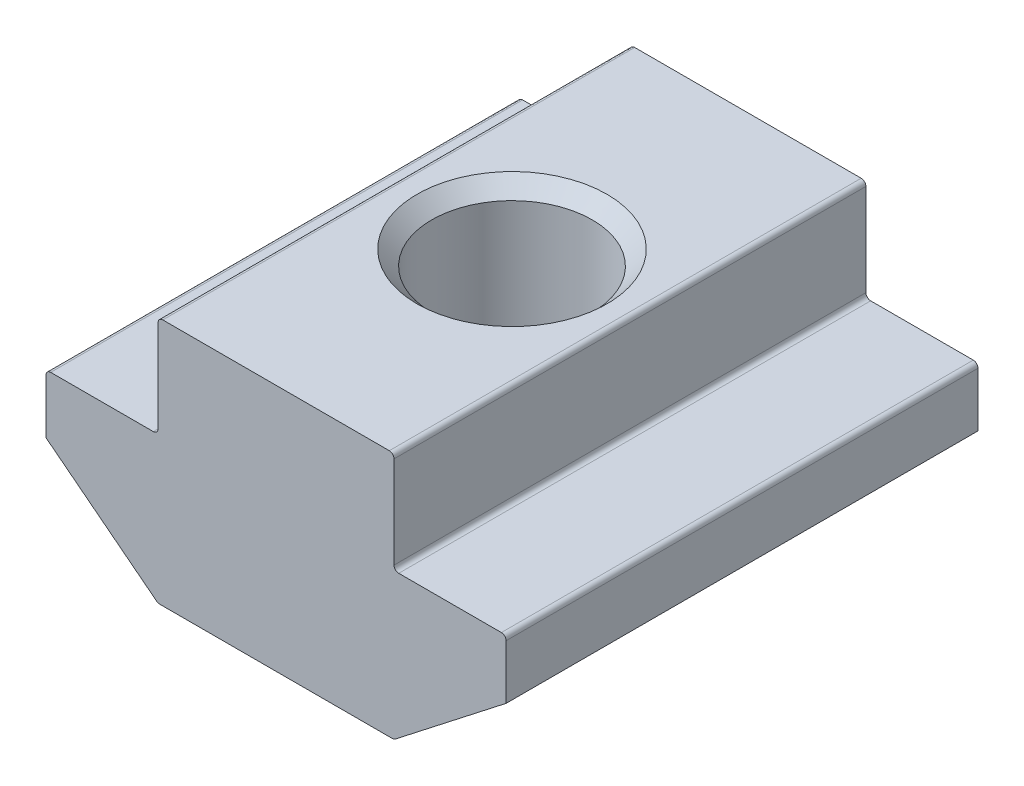
ISO-10303-21;
HEADER;
FILE_DESCRIPTION(('STEP AP214'),'2;1');
FILE_NAME('part.step','',(''),(''),'','','');
FILE_SCHEMA(('AUTOMOTIVE_DESIGN { 1 0 10303 214 1 1 1 1 }'));
ENDSEC;
DATA;
#1=APPLICATION_CONTEXT('core data for automotive mechanical design processes');
#2=APPLICATION_PROTOCOL_DEFINITION('international standard','automotive_design',2000,#1);
#3=PRODUCT_CONTEXT('',#1,'mechanical');
#4=PRODUCT('Part','Part','',(#3));
#5=PRODUCT_RELATED_PRODUCT_CATEGORY('part','',(#4));
#6=PRODUCT_DEFINITION_FORMATION('','',#4);
#7=PRODUCT_DEFINITION_CONTEXT('part definition',#1,'design');
#8=PRODUCT_DEFINITION('design','',#6,#7);
#9=PRODUCT_DEFINITION_SHAPE('','',#8);
#10=(LENGTH_UNIT() NAMED_UNIT(*) SI_UNIT(.MILLI.,.METRE.));
#11=(NAMED_UNIT(*) PLANE_ANGLE_UNIT() SI_UNIT($,.RADIAN.));
#12=(NAMED_UNIT(*) SI_UNIT($,.STERADIAN.) SOLID_ANGLE_UNIT());
#13=UNCERTAINTY_MEASURE_WITH_UNIT(LENGTH_MEASURE(1.E-05),#10,'distance_accuracy_value','');
#14=(GEOMETRIC_REPRESENTATION_CONTEXT(3) GLOBAL_UNCERTAINTY_ASSIGNED_CONTEXT((#13)) GLOBAL_UNIT_ASSIGNED_CONTEXT((#10,
#11,#12)) REPRESENTATION_CONTEXT('',''));
#15=CARTESIAN_POINT('',(0.,0.,0.));
#16=DIRECTION('',(0.,0.,1.));
#17=DIRECTION('',(1.,0.,0.));
#18=AXIS2_PLACEMENT_3D('',#15,#16,#17);
#19=CARTESIAN_POINT('',(-5.,0.,10.));
#20=DIRECTION('',(1.,0.,0.));
#21=DIRECTION('',(0.,1.,0.));
#22=AXIS2_PLACEMENT_3D('',#19,#20,#21);
#23=PLANE('',#22);
#24=DIRECTION('',(0.,-1.,0.));
#25=VECTOR('',#24,1.);
#26=CARTESIAN_POINT('',(-5.,0.,10.));
#27=LINE('',#26,#25);
#28=CARTESIAN_POINT('',(-5.,-0.200000000000003,10.));
#29=VERTEX_POINT('',#28);
#30=CARTESIAN_POINT('',(-5.,-4.1,10.));
#31=VERTEX_POINT('',#30);
#32=EDGE_CURVE('E233',#29,#31,#27,.T.);
#33=ORIENTED_EDGE('',*,*,#32,.F.);
#34=DIRECTION('',(0.,0.,-1.));
#35=VECTOR('',#34,1.);
#36=CARTESIAN_POINT('',(-5.,-0.200000000000003,10.));
#37=LINE('',#36,#35);
#38=CARTESIAN_POINT('',(-5.,-0.200000000000003,-10.));
#39=VERTEX_POINT('',#38);
#40=EDGE_CURVE('E284',#29,#39,#37,.T.);
#41=ORIENTED_EDGE('',*,*,#40,.T.);
#42=DIRECTION('',(0.,-1.,0.));
#43=VECTOR('',#42,1.);
#44=CARTESIAN_POINT('',(-5.,0.,-10.));
#45=LINE('',#44,#43);
#46=CARTESIAN_POINT('',(-5.,-4.1,-10.));
#47=VERTEX_POINT('',#46);
#48=EDGE_CURVE('E207',#39,#47,#45,.T.);
#49=ORIENTED_EDGE('',*,*,#48,.T.);
#50=DIRECTION('',(0.,0.,-1.));
#51=VECTOR('',#50,1.);
#52=CARTESIAN_POINT('',(-5.,-4.1,10.));
#53=LINE('',#52,#51);
#54=EDGE_CURVE('E282',#47,#31,#53,.F.);
#55=ORIENTED_EDGE('',*,*,#54,.T.);
#56=EDGE_LOOP('',(#33,#41,#49,#55));
#57=FACE_BOUND('',#56,.T.);
#58=ADVANCED_FACE('F36',(#57),#23,.F.);
#59=CARTESIAN_POINT('',(-5.,-4.3,10.));
#60=DIRECTION('',(0.,-1.,0.));
#61=DIRECTION('',(1.,0.,0.));
#62=AXIS2_PLACEMENT_3D('',#59,#60,#61);
#63=PLANE('',#62);
#64=DIRECTION('',(-1.,0.,0.));
#65=VECTOR('',#64,1.);
#66=CARTESIAN_POINT('',(-5.,-4.3,-10.));
#67=LINE('',#66,#65);
#68=CARTESIAN_POINT('',(-5.2,-4.3,-10.));
#69=VERTEX_POINT('',#68);
#70=CARTESIAN_POINT('',(-9.55,-4.3,-10.));
#71=VERTEX_POINT('',#70);
#72=EDGE_CURVE('E210',#69,#71,#67,.T.);
#73=ORIENTED_EDGE('',*,*,#72,.T.);
#74=DIRECTION('',(0.,0.,-1.));
#75=VECTOR('',#74,1.);
#76=CARTESIAN_POINT('',(-9.55,-4.3,10.));
#77=LINE('',#76,#75);
#78=CARTESIAN_POINT('',(-9.55,-4.3,10.));
#79=VERTEX_POINT('',#78);
#80=EDGE_CURVE('E292',#71,#79,#77,.F.);
#81=ORIENTED_EDGE('',*,*,#80,.T.);
#82=DIRECTION('',(-1.,0.,0.));
#83=VECTOR('',#82,1.);
#84=CARTESIAN_POINT('',(-5.,-4.3,10.));
#85=LINE('',#84,#83);
#86=CARTESIAN_POINT('',(-5.2,-4.3,10.));
#87=VERTEX_POINT('',#86);
#88=EDGE_CURVE('E174',#87,#79,#85,.T.);
#89=ORIENTED_EDGE('',*,*,#88,.F.);
#90=DIRECTION('',(0.,0.,-1.));
#91=VECTOR('',#90,1.);
#92=CARTESIAN_POINT('',(-5.2,-4.3,-10.));
#93=LINE('',#92,#91);
#94=EDGE_CURVE('E289',#87,#69,#93,.T.);
#95=ORIENTED_EDGE('',*,*,#94,.T.);
#96=EDGE_LOOP('',(#73,#81,#89,#95));
#97=FACE_BOUND('',#96,.T.);
#98=ADVANCED_FACE('F312',(#97),#63,.F.);
#99=CARTESIAN_POINT('',(-9.75,-4.3,10.));
#100=DIRECTION('',(1.,0.,0.));
#101=DIRECTION('',(0.,0.,-1.));
#102=AXIS2_PLACEMENT_3D('',#99,#100,#101);
#103=PLANE('',#102);
#104=DIRECTION('',(0.,-1.,0.));
#105=VECTOR('',#104,1.);
#106=CARTESIAN_POINT('',(-9.75,-4.3,10.));
#107=LINE('',#106,#105);
#108=CARTESIAN_POINT('',(-9.75,-4.5,10.));
#109=VERTEX_POINT('',#108);
#110=CARTESIAN_POINT('',(-9.75,-6.8,10.));
#111=VERTEX_POINT('',#110);
#112=EDGE_CURVE('E161',#109,#111,#107,.T.);
#113=ORIENTED_EDGE('',*,*,#112,.F.);
#114=DIRECTION('',(0.,0.,-1.));
#115=VECTOR('',#114,1.);
#116=CARTESIAN_POINT('',(-9.75,-4.5,10.));
#117=LINE('',#116,#115);
#118=CARTESIAN_POINT('',(-9.75,-4.5,-10.));
#119=VERTEX_POINT('',#118);
#120=EDGE_CURVE('E287',#109,#119,#117,.T.);
#121=ORIENTED_EDGE('',*,*,#120,.T.);
#122=DIRECTION('',(0.,-1.,0.));
#123=VECTOR('',#122,1.);
#124=CARTESIAN_POINT('',(-9.75,-4.3,-10.));
#125=LINE('',#124,#123);
#126=CARTESIAN_POINT('',(-9.75,-6.8,-10.));
#127=VERTEX_POINT('',#126);
#128=EDGE_CURVE('E180',#119,#127,#125,.T.);
#129=ORIENTED_EDGE('',*,*,#128,.T.);
#130=DIRECTION('',(0.,0.,-1.));
#131=VECTOR('',#130,1.);
#132=CARTESIAN_POINT('',(-9.75,-6.8,10.));
#133=LINE('',#132,#131);
#134=EDGE_CURVE('E177',#111,#127,#133,.T.);
#135=ORIENTED_EDGE('',*,*,#134,.F.);
#136=EDGE_LOOP('',(#113,#121,#129,#135));
#137=FACE_BOUND('',#136,.T.);
#138=ADVANCED_FACE('F178',(#137),#103,.F.);
#139=CARTESIAN_POINT('',(-9.75,-6.8,10.));
#140=DIRECTION('',(0.614515361098146,0.788904855463836,0.));
#141=DIRECTION('',(-0.788904855463836,0.614515361098146,0.));
#142=AXIS2_PLACEMENT_3D('',#139,#140,#141);
#143=PLANE('',#142);
#144=DIRECTION('',(0.788904855463836,-0.614515361098146,0.));
#145=VECTOR('',#144,1.);
#146=CARTESIAN_POINT('',(-9.75,-6.8,-10.));
#147=LINE('',#146,#145);
#148=CARTESIAN_POINT('',(-5.05420010467821,-10.4577809710928,-10.));
#149=VERTEX_POINT('',#148);
#150=EDGE_CURVE('E215',#127,#149,#147,.T.);
#151=ORIENTED_EDGE('',*,*,#150,.T.);
#152=DIRECTION('',(0.,0.,-1.));
#153=VECTOR('',#152,1.);
#154=CARTESIAN_POINT('',(-5.05420010467821,-10.4577809710928,10.));
#155=LINE('',#154,#153);
#156=CARTESIAN_POINT('',(-5.05420010467821,-10.4577809710928,10.));
#157=VERTEX_POINT('',#156);
#158=EDGE_CURVE('E189',#149,#157,#155,.F.);
#159=ORIENTED_EDGE('',*,*,#158,.T.);
#160=DIRECTION('',(0.788904855463836,-0.614515361098146,0.));
#161=VECTOR('',#160,1.);
#162=CARTESIAN_POINT('',(-9.75,-6.8,10.));
#163=LINE('',#162,#161);
#164=EDGE_CURVE('E166',#111,#157,#163,.T.);
#165=ORIENTED_EDGE('',*,*,#164,.F.);
#166=ORIENTED_EDGE('',*,*,#134,.T.);
#167=EDGE_LOOP('',(#151,#159,#165,#166));
#168=FACE_BOUND('',#167,.T.);
#169=ADVANCED_FACE('F187',(#168),#143,.F.);
#170=CARTESIAN_POINT('',(-5.,-10.5,10.));
#171=DIRECTION('',(0.,1.,0.));
#172=DIRECTION('',(0.,0.,1.));
#173=AXIS2_PLACEMENT_3D('',#170,#171,#172);
#174=PLANE('',#173);
#175=CARTESIAN_POINT('',(0.,-10.5,0.));
#176=DIRECTION('',(0.,1.,0.));
#177=DIRECTION('',(0.,0.,1.));
#178=AXIS2_PLACEMENT_3D('',#175,#176,#177);
#179=CIRCLE('',#178,4.025);
#180=CARTESIAN_POINT('',(0.,-10.5,4.025));
#181=VERTEX_POINT('',#180);
#182=EDGE_CURVE('E324',#181,#181,#179,.T.);
#183=ORIENTED_EDGE('',*,*,#182,.T.);
#184=EDGE_LOOP('',(#183));
#185=FACE_BOUND('',#184,.T.);
#186=DIRECTION('',(1.,0.,0.));
#187=VECTOR('',#186,1.);
#188=CARTESIAN_POINT('',(-5.,-10.5,-10.));
#189=LINE('',#188,#187);
#190=CARTESIAN_POINT('',(-4.93129703245858,-10.5,-10.));
#191=VERTEX_POINT('',#190);
#192=CARTESIAN_POINT('',(4.93129703245858,-10.5,-10.));
#193=VERTEX_POINT('',#192);
#194=EDGE_CURVE('E217',#191,#193,#189,.T.);
#195=ORIENTED_EDGE('',*,*,#194,.T.);
#196=DIRECTION('',(0.,0.,-1.));
#197=VECTOR('',#196,1.);
#198=CARTESIAN_POINT('',(4.93129703245858,-10.5,10.));
#199=LINE('',#198,#197);
#200=CARTESIAN_POINT('',(4.93129703245858,-10.5,10.));
#201=VERTEX_POINT('',#200);
#202=EDGE_CURVE('E253',#193,#201,#199,.F.);
#203=ORIENTED_EDGE('',*,*,#202,.T.);
#204=DIRECTION('',(1.,0.,0.));
#205=VECTOR('',#204,1.);
#206=CARTESIAN_POINT('',(-5.,-10.5,10.));
#207=LINE('',#206,#205);
#208=CARTESIAN_POINT('',(-4.93129703245858,-10.5,10.));
#209=VERTEX_POINT('',#208);
#210=EDGE_CURVE('E190',#209,#201,#207,.T.);
#211=ORIENTED_EDGE('',*,*,#210,.F.);
#212=DIRECTION('',(0.,0.,-1.));
#213=VECTOR('',#212,1.);
#214=CARTESIAN_POINT('',(-4.93129703245858,-10.5,10.));
#215=LINE('',#214,#213);
#216=EDGE_CURVE('E250',#209,#191,#215,.T.);
#217=ORIENTED_EDGE('',*,*,#216,.T.);
#218=EDGE_LOOP('',(#195,#203,#211,#217));
#219=FACE_BOUND('',#218,.T.);
#220=ADVANCED_FACE('F328',(#185,#219),#174,.F.);
#221=CARTESIAN_POINT('',(9.75,-6.8,10.));
#222=DIRECTION('',(-0.614515361098146,0.788904855463836,0.));
#223=DIRECTION('',(-0.788904855463836,-0.614515361098146,0.));
#224=AXIS2_PLACEMENT_3D('',#221,#222,#223);
#225=PLANE('',#224);
#226=DIRECTION('',(0.788904855463836,0.614515361098146,0.));
#227=VECTOR('',#226,1.);
#228=CARTESIAN_POINT('',(9.75,-6.8,10.));
#229=LINE('',#228,#227);
#230=CARTESIAN_POINT('',(5.05420010467821,-10.4577809710928,10.));
#231=VERTEX_POINT('',#230);
#232=CARTESIAN_POINT('',(9.75,-6.8,10.));
#233=VERTEX_POINT('',#232);
#234=EDGE_CURVE('E192',#231,#233,#229,.T.);
#235=ORIENTED_EDGE('',*,*,#234,.F.);
#236=DIRECTION('',(0.,0.,-1.));
#237=VECTOR('',#236,1.);
#238=CARTESIAN_POINT('',(5.05420010467821,-10.4577809710928,10.));
#239=LINE('',#238,#237);
#240=CARTESIAN_POINT('',(5.05420010467821,-10.4577809710928,-10.));
#241=VERTEX_POINT('',#240);
#242=EDGE_CURVE('E184',#231,#241,#239,.T.);
#243=ORIENTED_EDGE('',*,*,#242,.T.);
#244=DIRECTION('',(0.788904855463836,0.614515361098146,0.));
#245=VECTOR('',#244,1.);
#246=CARTESIAN_POINT('',(9.75,-6.8,-10.));
#247=LINE('',#246,#245);
#248=CARTESIAN_POINT('',(9.75,-6.8,-10.));
#249=VERTEX_POINT('',#248);
#250=EDGE_CURVE('E220',#241,#249,#247,.T.);
#251=ORIENTED_EDGE('',*,*,#250,.T.);
#252=DIRECTION('',(0.,0.,-1.));
#253=VECTOR('',#252,1.);
#254=CARTESIAN_POINT('',(9.75,-6.8,10.));
#255=LINE('',#254,#253);
#256=EDGE_CURVE('E185',#233,#249,#255,.T.);
#257=ORIENTED_EDGE('',*,*,#256,.F.);
#258=EDGE_LOOP('',(#235,#243,#251,#257));
#259=FACE_BOUND('',#258,.T.);
#260=ADVANCED_FACE('F384',(#259),#225,.F.);
#261=CARTESIAN_POINT('',(9.75,-4.3,10.));
#262=DIRECTION('',(-1.,0.,0.));
#263=DIRECTION('',(0.,0.,1.));
#264=AXIS2_PLACEMENT_3D('',#261,#262,#263);
#265=PLANE('',#264);
#266=DIRECTION('',(0.,1.,0.));
#267=VECTOR('',#266,1.);
#268=CARTESIAN_POINT('',(9.75,-4.3,-10.));
#269=LINE('',#268,#267);
#270=CARTESIAN_POINT('',(9.75,-4.5,-10.));
#271=VERTEX_POINT('',#270);
#272=EDGE_CURVE('E222',#249,#271,#269,.T.);
#273=ORIENTED_EDGE('',*,*,#272,.T.);
#274=DIRECTION('',(0.,0.,-1.));
#275=VECTOR('',#274,1.);
#276=CARTESIAN_POINT('',(9.75,-4.5,10.));
#277=LINE('',#276,#275);
#278=CARTESIAN_POINT('',(9.75,-4.5,10.));
#279=VERTEX_POINT('',#278);
#280=EDGE_CURVE('E271',#271,#279,#277,.F.);
#281=ORIENTED_EDGE('',*,*,#280,.T.);
#282=DIRECTION('',(0.,1.,0.));
#283=VECTOR('',#282,1.);
#284=CARTESIAN_POINT('',(9.75,-4.3,10.));
#285=LINE('',#284,#283);
#286=EDGE_CURVE('E197',#233,#279,#285,.T.);
#287=ORIENTED_EDGE('',*,*,#286,.F.);
#288=ORIENTED_EDGE('',*,*,#256,.T.);
#289=EDGE_LOOP('',(#273,#281,#287,#288));
#290=FACE_BOUND('',#289,.T.);
#291=ADVANCED_FACE('F379',(#290),#265,.F.);
#292=CARTESIAN_POINT('',(5.,-4.3,10.));
#293=DIRECTION('',(0.,-1.,0.));
#294=DIRECTION('',(1.,0.,0.));
#295=AXIS2_PLACEMENT_3D('',#292,#293,#294);
#296=PLANE('',#295);
#297=DIRECTION('',(-1.,0.,0.));
#298=VECTOR('',#297,1.);
#299=CARTESIAN_POINT('',(5.,-4.3,10.));
#300=LINE('',#299,#298);
#301=CARTESIAN_POINT('',(9.55,-4.3,10.));
#302=VERTEX_POINT('',#301);
#303=CARTESIAN_POINT('',(5.2,-4.3,10.));
#304=VERTEX_POINT('',#303);
#305=EDGE_CURVE('E200',#302,#304,#300,.T.);
#306=ORIENTED_EDGE('',*,*,#305,.F.);
#307=DIRECTION('',(0.,0.,-1.));
#308=VECTOR('',#307,1.);
#309=CARTESIAN_POINT('',(9.55,-4.3,10.));
#310=LINE('',#309,#308);
#311=CARTESIAN_POINT('',(9.55,-4.3,-10.));
#312=VERTEX_POINT('',#311);
#313=EDGE_CURVE('E268',#302,#312,#310,.T.);
#314=ORIENTED_EDGE('',*,*,#313,.T.);
#315=DIRECTION('',(-1.,0.,0.));
#316=VECTOR('',#315,1.);
#317=CARTESIAN_POINT('',(5.,-4.3,-10.));
#318=LINE('',#317,#316);
#319=CARTESIAN_POINT('',(5.2,-4.3,-10.));
#320=VERTEX_POINT('',#319);
#321=EDGE_CURVE('E225',#312,#320,#318,.T.);
#322=ORIENTED_EDGE('',*,*,#321,.T.);
#323=DIRECTION('',(0.,0.,-1.));
#324=VECTOR('',#323,1.);
#325=CARTESIAN_POINT('',(5.2,-4.3,10.));
#326=LINE('',#325,#324);
#327=EDGE_CURVE('E266',#320,#304,#326,.F.);
#328=ORIENTED_EDGE('',*,*,#327,.T.);
#329=EDGE_LOOP('',(#306,#314,#322,#328));
#330=FACE_BOUND('',#329,.T.);
#331=ADVANCED_FACE('F371',(#330),#296,.F.);
#332=CARTESIAN_POINT('',(5.,0.,10.));
#333=DIRECTION('',(-1.,0.,0.));
#334=DIRECTION('',(0.,-1.,0.));
#335=AXIS2_PLACEMENT_3D('',#332,#333,#334);
#336=PLANE('',#335);
#337=DIRECTION('',(0.,1.,0.));
#338=VECTOR('',#337,1.);
#339=CARTESIAN_POINT('',(5.,0.,10.));
#340=LINE('',#339,#338);
#341=CARTESIAN_POINT('',(5.,-4.1,10.));
#342=VERTEX_POINT('',#341);
#343=CARTESIAN_POINT('',(5.,-0.199999999999997,10.));
#344=VERTEX_POINT('',#343);
#345=EDGE_CURVE('E203',#342,#344,#340,.T.);
#346=ORIENTED_EDGE('',*,*,#345,.F.);
#347=DIRECTION('',(0.,0.,-1.));
#348=VECTOR('',#347,1.);
#349=CARTESIAN_POINT('',(5.,-4.1,-10.));
#350=LINE('',#349,#348);
#351=CARTESIAN_POINT('',(5.,-4.1,-10.));
#352=VERTEX_POINT('',#351);
#353=EDGE_CURVE('E275',#342,#352,#350,.T.);
#354=ORIENTED_EDGE('',*,*,#353,.T.);
#355=DIRECTION('',(0.,1.,0.));
#356=VECTOR('',#355,1.);
#357=CARTESIAN_POINT('',(5.,0.,-10.));
#358=LINE('',#357,#356);
#359=CARTESIAN_POINT('',(5.,-0.199999999999997,-10.));
#360=VERTEX_POINT('',#359);
#361=EDGE_CURVE('E228',#352,#360,#358,.T.);
#362=ORIENTED_EDGE('',*,*,#361,.T.);
#363=DIRECTION('',(0.,0.,-1.));
#364=VECTOR('',#363,1.);
#365=CARTESIAN_POINT('',(5.,-0.199999999999997,10.));
#366=LINE('',#365,#364);
#367=EDGE_CURVE('E273',#360,#344,#366,.F.);
#368=ORIENTED_EDGE('',*,*,#367,.T.);
#369=EDGE_LOOP('',(#346,#354,#362,#368));
#370=FACE_BOUND('',#369,.T.);
#371=ADVANCED_FACE('F352',(#370),#336,.F.);
#372=CARTESIAN_POINT('',(5.,0.,10.));
#373=DIRECTION('',(0.,-1.,0.));
#374=DIRECTION('',(1.,0.,0.));
#375=AXIS2_PLACEMENT_3D('',#372,#373,#374);
#376=PLANE('',#375);
#377=CARTESIAN_POINT('',(0.,0.,0.));
#378=DIRECTION('',(0.,1.,0.));
#379=DIRECTION('',(0.,0.,1.));
#380=AXIS2_PLACEMENT_3D('',#377,#378,#379);
#381=CIRCLE('',#380,4.025);
#382=CARTESIAN_POINT('',(0.,0.,4.025));
#383=VERTEX_POINT('',#382);
#384=EDGE_CURVE('E321',#383,#383,#381,.T.);
#385=ORIENTED_EDGE('',*,*,#384,.F.);
#386=EDGE_LOOP('',(#385));
#387=FACE_BOUND('',#386,.T.);
#388=DIRECTION('',(-1.,0.,0.));
#389=VECTOR('',#388,1.);
#390=CARTESIAN_POINT('',(5.,0.,10.));
#391=LINE('',#390,#389);
#392=CARTESIAN_POINT('',(4.8,0.,10.));
#393=VERTEX_POINT('',#392);
#394=CARTESIAN_POINT('',(-4.8,0.,10.));
#395=VERTEX_POINT('',#394);
#396=EDGE_CURVE('E205',#393,#395,#391,.T.);
#397=ORIENTED_EDGE('',*,*,#396,.F.);
#398=DIRECTION('',(0.,0.,-1.));
#399=VECTOR('',#398,1.);
#400=CARTESIAN_POINT('',(4.8,0.,10.));
#401=LINE('',#400,#399);
#402=CARTESIAN_POINT('',(4.8,0.,-10.));
#403=VERTEX_POINT('',#402);
#404=EDGE_CURVE('E279',#393,#403,#401,.T.);
#405=ORIENTED_EDGE('',*,*,#404,.T.);
#406=DIRECTION('',(-1.,0.,0.));
#407=VECTOR('',#406,1.);
#408=CARTESIAN_POINT('',(5.,0.,-10.));
#409=LINE('',#408,#407);
#410=CARTESIAN_POINT('',(-4.8,0.,-10.));
#411=VERTEX_POINT('',#410);
#412=EDGE_CURVE('E231',#403,#411,#409,.T.);
#413=ORIENTED_EDGE('',*,*,#412,.T.);
#414=DIRECTION('',(0.,0.,-1.));
#415=VECTOR('',#414,1.);
#416=CARTESIAN_POINT('',(-4.8,0.,10.));
#417=LINE('',#416,#415);
#418=EDGE_CURVE('E51',#411,#395,#417,.F.);
#419=ORIENTED_EDGE('',*,*,#418,.T.);
#420=EDGE_LOOP('',(#397,#405,#413,#419));
#421=FACE_BOUND('',#420,.T.);
#422=ADVANCED_FACE('F350',(#387,#421),#376,.F.);
#423=CARTESIAN_POINT('',(0.,0.,10.));
#424=DIRECTION('',(0.,0.,-1.));
#425=DIRECTION('',(-1.,0.,0.));
#426=AXIS2_PLACEMENT_3D('',#423,#424,#425);
#427=PLANE('',#426);
#428=ORIENTED_EDGE('',*,*,#210,.T.);
#429=CARTESIAN_POINT('',(4.93129703245858,-10.3,10.));
#430=DIRECTION('',(0.,0.,-1.));
#431=DIRECTION('',(-1.,0.,0.));
#432=AXIS2_PLACEMENT_3D('',#429,#430,#431);
#433=CIRCLE('',#432,0.2);
#434=EDGE_CURVE('E263',#201,#231,#433,.F.);
#435=ORIENTED_EDGE('',*,*,#434,.T.);
#436=ORIENTED_EDGE('',*,*,#234,.T.);
#437=ORIENTED_EDGE('',*,*,#286,.T.);
#438=CARTESIAN_POINT('',(9.55,-4.5,10.));
#439=DIRECTION('',(0.,0.,-1.));
#440=DIRECTION('',(-1.,0.,0.));
#441=AXIS2_PLACEMENT_3D('',#438,#439,#440);
#442=CIRCLE('',#441,0.2);
#443=EDGE_CURVE('E259',#279,#302,#442,.F.);
#444=ORIENTED_EDGE('',*,*,#443,.T.);
#445=ORIENTED_EDGE('',*,*,#305,.T.);
#446=CARTESIAN_POINT('',(5.2,-4.1,10.));
#447=DIRECTION('',(0.,0.,-1.));
#448=DIRECTION('',(-1.,0.,0.));
#449=AXIS2_PLACEMENT_3D('',#446,#447,#448);
#450=CIRCLE('',#449,0.2);
#451=EDGE_CURVE('E296',#304,#342,#450,.T.);
#452=ORIENTED_EDGE('',*,*,#451,.T.);
#453=ORIENTED_EDGE('',*,*,#345,.T.);
#454=CARTESIAN_POINT('',(4.8,-0.199999999999998,10.));
#455=DIRECTION('',(0.,0.,-1.));
#456=DIRECTION('',(-1.,0.,0.));
#457=AXIS2_PLACEMENT_3D('',#454,#455,#456);
#458=CIRCLE('',#457,0.2);
#459=EDGE_CURVE('E58',#344,#393,#458,.F.);
#460=ORIENTED_EDGE('',*,*,#459,.T.);
#461=ORIENTED_EDGE('',*,*,#396,.T.);
#462=CARTESIAN_POINT('',(-4.8,-0.200000000000003,10.));
#463=DIRECTION('',(0.,0.,-1.));
#464=DIRECTION('',(-1.,0.,0.));
#465=AXIS2_PLACEMENT_3D('',#462,#463,#464);
#466=CIRCLE('',#465,0.2);
#467=EDGE_CURVE('E256',#395,#29,#466,.F.);
#468=ORIENTED_EDGE('',*,*,#467,.T.);
#469=ORIENTED_EDGE('',*,*,#32,.T.);
#470=CARTESIAN_POINT('',(-5.2,-4.1,10.));
#471=DIRECTION('',(0.,0.,-1.));
#472=DIRECTION('',(-1.,0.,0.));
#473=AXIS2_PLACEMENT_3D('',#470,#471,#472);
#474=CIRCLE('',#473,0.2);
#475=EDGE_CURVE('E11',#31,#87,#474,.T.);
#476=ORIENTED_EDGE('',*,*,#475,.T.);
#477=ORIENTED_EDGE('',*,*,#88,.T.);
#478=CARTESIAN_POINT('',(-9.55,-4.5,10.));
#479=DIRECTION('',(0.,0.,-1.));
#480=DIRECTION('',(-1.,0.,0.));
#481=AXIS2_PLACEMENT_3D('',#478,#479,#480);
#482=CIRCLE('',#481,0.2);
#483=EDGE_CURVE('E170',#79,#109,#482,.F.);
#484=ORIENTED_EDGE('',*,*,#483,.T.);
#485=ORIENTED_EDGE('',*,*,#112,.T.);
#486=ORIENTED_EDGE('',*,*,#164,.T.);
#487=CARTESIAN_POINT('',(-4.93129703245858,-10.3,10.));
#488=DIRECTION('',(0.,0.,-1.));
#489=DIRECTION('',(-1.,0.,0.));
#490=AXIS2_PLACEMENT_3D('',#487,#488,#489);
#491=CIRCLE('',#490,0.2);
#492=EDGE_CURVE('E261',#157,#209,#491,.F.);
#493=ORIENTED_EDGE('',*,*,#492,.T.);
#494=EDGE_LOOP('',(#428,#435,#436,#437,#444,#445,#452,#453,#460,#461,#468,#469,#476,#477,#484,
#485,#486,#493));
#495=FACE_BOUND('',#494,.T.);
#496=ADVANCED_FACE('F164',(#495),#427,.F.);
#497=CARTESIAN_POINT('',(0.,0.,-10.));
#498=DIRECTION('',(0.,0.,-1.));
#499=DIRECTION('',(-1.,0.,0.));
#500=AXIS2_PLACEMENT_3D('',#497,#498,#499);
#501=PLANE('',#500);
#502=ORIENTED_EDGE('',*,*,#250,.F.);
#503=CARTESIAN_POINT('',(4.93129703245858,-10.3,-10.));
#504=DIRECTION('',(0.,0.,-1.));
#505=DIRECTION('',(-1.,0.,0.));
#506=AXIS2_PLACEMENT_3D('',#503,#504,#505);
#507=CIRCLE('',#506,0.2);
#508=EDGE_CURVE('E248',#241,#193,#507,.T.);
#509=ORIENTED_EDGE('',*,*,#508,.T.);
#510=ORIENTED_EDGE('',*,*,#194,.F.);
#511=CARTESIAN_POINT('',(-4.93129703245858,-10.3,-10.));
#512=DIRECTION('',(0.,0.,-1.));
#513=DIRECTION('',(-1.,0.,0.));
#514=AXIS2_PLACEMENT_3D('',#511,#512,#513);
#515=CIRCLE('',#514,0.2);
#516=EDGE_CURVE('E246',#191,#149,#515,.T.);
#517=ORIENTED_EDGE('',*,*,#516,.T.);
#518=ORIENTED_EDGE('',*,*,#150,.F.);
#519=ORIENTED_EDGE('',*,*,#128,.F.);
#520=CARTESIAN_POINT('',(-9.55,-4.5,-10.));
#521=DIRECTION('',(0.,0.,-1.));
#522=DIRECTION('',(-1.,0.,0.));
#523=AXIS2_PLACEMENT_3D('',#520,#521,#522);
#524=CIRCLE('',#523,0.2);
#525=EDGE_CURVE('E238',#119,#71,#524,.T.);
#526=ORIENTED_EDGE('',*,*,#525,.T.);
#527=ORIENTED_EDGE('',*,*,#72,.F.);
#528=CARTESIAN_POINT('',(-5.2,-4.1,-10.));
#529=DIRECTION('',(0.,0.,-1.));
#530=DIRECTION('',(-1.,0.,0.));
#531=AXIS2_PLACEMENT_3D('',#528,#529,#530);
#532=CIRCLE('',#531,0.2);
#533=EDGE_CURVE('E44',#69,#47,#532,.F.);
#534=ORIENTED_EDGE('',*,*,#533,.T.);
#535=ORIENTED_EDGE('',*,*,#48,.F.);
#536=CARTESIAN_POINT('',(-4.8,-0.200000000000003,-10.));
#537=DIRECTION('',(0.,0.,-1.));
#538=DIRECTION('',(-1.,0.,0.));
#539=AXIS2_PLACEMENT_3D('',#536,#537,#538);
#540=CIRCLE('',#539,0.2);
#541=EDGE_CURVE('E240',#39,#411,#540,.T.);
#542=ORIENTED_EDGE('',*,*,#541,.T.);
#543=ORIENTED_EDGE('',*,*,#412,.F.);
#544=CARTESIAN_POINT('',(4.8,-0.199999999999998,-10.));
#545=DIRECTION('',(0.,0.,-1.));
#546=DIRECTION('',(-1.,0.,0.));
#547=AXIS2_PLACEMENT_3D('',#544,#545,#546);
#548=CIRCLE('',#547,0.2);
#549=EDGE_CURVE('E242',#403,#360,#548,.T.);
#550=ORIENTED_EDGE('',*,*,#549,.T.);
#551=ORIENTED_EDGE('',*,*,#361,.F.);
#552=CARTESIAN_POINT('',(5.2,-4.1,-10.));
#553=DIRECTION('',(0.,0.,-1.));
#554=DIRECTION('',(-1.,0.,0.));
#555=AXIS2_PLACEMENT_3D('',#552,#553,#554);
#556=CIRCLE('',#555,0.2);
#557=EDGE_CURVE('E294',#352,#320,#556,.F.);
#558=ORIENTED_EDGE('',*,*,#557,.T.);
#559=ORIENTED_EDGE('',*,*,#321,.F.);
#560=CARTESIAN_POINT('',(9.55,-4.5,-10.));
#561=DIRECTION('',(0.,0.,-1.));
#562=DIRECTION('',(-1.,0.,0.));
#563=AXIS2_PLACEMENT_3D('',#560,#561,#562);
#564=CIRCLE('',#563,0.2);
#565=EDGE_CURVE('E244',#312,#271,#564,.T.);
#566=ORIENTED_EDGE('',*,*,#565,.T.);
#567=ORIENTED_EDGE('',*,*,#272,.F.);
#568=EDGE_LOOP('',(#502,#509,#510,#517,#518,#519,#526,#527,#534,#535,#542,#543,#550,#551,#558,
#559,#566,#567));
#569=FACE_BOUND('',#568,.T.);
#570=ADVANCED_FACE('F301',(#569),#501,.T.);
#571=CARTESIAN_POINT('',(0.,-9.875,0.));
#572=DIRECTION('',(0.,-1.,0.));
#573=DIRECTION('',(0.,0.,-1.));
#574=AXIS2_PLACEMENT_3D('',#571,#572,#573);
#575=CONICAL_SURFACE('',#574,3.4,0.785398163397445);
#576=ORIENTED_EDGE('',*,*,#182,.F.);
#577=EDGE_LOOP('',(#576));
#578=FACE_BOUND('',#577,.T.);
#579=CARTESIAN_POINT('',(0.,-9.875,0.));
#580=DIRECTION('',(0.,1.,0.));
#581=DIRECTION('',(0.,0.,1.));
#582=AXIS2_PLACEMENT_3D('',#579,#580,#581);
#583=CIRCLE('',#582,3.4);
#584=CARTESIAN_POINT('',(0.,-9.875,3.4));
#585=VERTEX_POINT('',#584);
#586=EDGE_CURVE('E211',#585,#585,#583,.T.);
#587=ORIENTED_EDGE('',*,*,#586,.T.);
#588=EDGE_LOOP('',(#587));
#589=FACE_BOUND('',#588,.T.);
#590=ADVANCED_FACE('F331',(#578,#589),#575,.F.);
#591=CARTESIAN_POINT('',(0.,0.,0.));
#592=DIRECTION('',(0.,1.,0.));
#593=DIRECTION('',(0.,0.,1.));
#594=AXIS2_PLACEMENT_3D('',#591,#592,#593);
#595=CYLINDRICAL_SURFACE('',#594,3.4);
#596=ORIENTED_EDGE('',*,*,#586,.F.);
#597=EDGE_LOOP('',(#596));
#598=FACE_BOUND('',#597,.T.);
#599=CARTESIAN_POINT('',(0.,-0.625,0.));
#600=DIRECTION('',(0.,1.,0.));
#601=DIRECTION('',(0.,0.,1.));
#602=AXIS2_PLACEMENT_3D('',#599,#600,#601);
#603=CIRCLE('',#602,3.4);
#604=CARTESIAN_POINT('',(0.,-0.625,3.4));
#605=VERTEX_POINT('',#604);
#606=EDGE_CURVE('E318',#605,#605,#603,.T.);
#607=ORIENTED_EDGE('',*,*,#606,.T.);
#608=EDGE_LOOP('',(#607));
#609=FACE_BOUND('',#608,.T.);
#610=ADVANCED_FACE('F334',(#598,#609),#595,.F.);
#611=CARTESIAN_POINT('',(0.,0.,0.));
#612=DIRECTION('',(0.,1.,0.));
#613=DIRECTION('',(0.,0.,1.));
#614=AXIS2_PLACEMENT_3D('',#611,#612,#613);
#615=CONICAL_SURFACE('',#614,4.025,0.78539816339745);
#616=ORIENTED_EDGE('',*,*,#606,.F.);
#617=EDGE_LOOP('',(#616));
#618=FACE_BOUND('',#617,.T.);
#619=ORIENTED_EDGE('',*,*,#384,.T.);
#620=EDGE_LOOP('',(#619));
#621=FACE_BOUND('',#620,.T.);
#622=ADVANCED_FACE('F340',(#618,#621),#615,.F.);
#623=CARTESIAN_POINT('',(4.93129703245858,-10.3,10.));
#624=DIRECTION('',(0.,0.,-1.));
#625=DIRECTION('',(-1.,0.,0.));
#626=AXIS2_PLACEMENT_3D('',#623,#624,#625);
#627=CYLINDRICAL_SURFACE('',#626,0.2);
#628=ORIENTED_EDGE('',*,*,#434,.F.);
#629=ORIENTED_EDGE('',*,*,#202,.F.);
#630=ORIENTED_EDGE('',*,*,#508,.F.);
#631=ORIENTED_EDGE('',*,*,#242,.F.);
#632=EDGE_LOOP('',(#628,#629,#630,#631));
#633=FACE_BOUND('',#632,.T.);
#634=ADVANCED_FACE('F346',(#633),#627,.T.);
#635=CARTESIAN_POINT('',(-4.93129703245858,-10.3,10.));
#636=DIRECTION('',(0.,0.,-1.));
#637=DIRECTION('',(-1.,0.,0.));
#638=AXIS2_PLACEMENT_3D('',#635,#636,#637);
#639=CYLINDRICAL_SURFACE('',#638,0.2);
#640=ORIENTED_EDGE('',*,*,#492,.F.);
#641=ORIENTED_EDGE('',*,*,#158,.F.);
#642=ORIENTED_EDGE('',*,*,#516,.F.);
#643=ORIENTED_EDGE('',*,*,#216,.F.);
#644=EDGE_LOOP('',(#640,#641,#642,#643));
#645=FACE_BOUND('',#644,.T.);
#646=ADVANCED_FACE('F393',(#645),#639,.T.);
#647=CARTESIAN_POINT('',(9.55,-4.5,10.));
#648=DIRECTION('',(0.,0.,-1.));
#649=DIRECTION('',(-1.,0.,0.));
#650=AXIS2_PLACEMENT_3D('',#647,#648,#649);
#651=CYLINDRICAL_SURFACE('',#650,0.2);
#652=ORIENTED_EDGE('',*,*,#443,.F.);
#653=ORIENTED_EDGE('',*,*,#280,.F.);
#654=ORIENTED_EDGE('',*,*,#565,.F.);
#655=ORIENTED_EDGE('',*,*,#313,.F.);
#656=EDGE_LOOP('',(#652,#653,#654,#655));
#657=FACE_BOUND('',#656,.T.);
#658=ADVANCED_FACE('F375',(#657),#651,.T.);
#659=CARTESIAN_POINT('',(5.2,-4.1,10.));
#660=DIRECTION('',(0.,0.,1.));
#661=DIRECTION('',(1.,0.,0.));
#662=AXIS2_PLACEMENT_3D('',#659,#660,#661);
#663=CYLINDRICAL_SURFACE('',#662,0.2);
#664=ORIENTED_EDGE('',*,*,#451,.F.);
#665=ORIENTED_EDGE('',*,*,#327,.F.);
#666=ORIENTED_EDGE('',*,*,#557,.F.);
#667=ORIENTED_EDGE('',*,*,#353,.F.);
#668=EDGE_LOOP('',(#664,#665,#666,#667));
#669=FACE_BOUND('',#668,.T.);
#670=ADVANCED_FACE('F366',(#669),#663,.F.);
#671=CARTESIAN_POINT('',(4.8,-0.199999999999998,10.));
#672=DIRECTION('',(0.,0.,-1.));
#673=DIRECTION('',(-1.,0.,0.));
#674=AXIS2_PLACEMENT_3D('',#671,#672,#673);
#675=CYLINDRICAL_SURFACE('',#674,0.2);
#676=ORIENTED_EDGE('',*,*,#459,.F.);
#677=ORIENTED_EDGE('',*,*,#367,.F.);
#678=ORIENTED_EDGE('',*,*,#549,.F.);
#679=ORIENTED_EDGE('',*,*,#404,.F.);
#680=EDGE_LOOP('',(#676,#677,#678,#679));
#681=FACE_BOUND('',#680,.T.);
#682=ADVANCED_FACE('F358',(#681),#675,.T.);
#683=CARTESIAN_POINT('',(-4.8,-0.200000000000003,10.));
#684=DIRECTION('',(0.,0.,-1.));
#685=DIRECTION('',(-1.,0.,0.));
#686=AXIS2_PLACEMENT_3D('',#683,#684,#685);
#687=CYLINDRICAL_SURFACE('',#686,0.2);
#688=ORIENTED_EDGE('',*,*,#467,.F.);
#689=ORIENTED_EDGE('',*,*,#418,.F.);
#690=ORIENTED_EDGE('',*,*,#541,.F.);
#691=ORIENTED_EDGE('',*,*,#40,.F.);
#692=EDGE_LOOP('',(#688,#689,#690,#691));
#693=FACE_BOUND('',#692,.T.);
#694=ADVANCED_FACE('F397',(#693),#687,.T.);
#695=CARTESIAN_POINT('',(-9.55,-4.5,10.));
#696=DIRECTION('',(0.,0.,-1.));
#697=DIRECTION('',(-1.,0.,0.));
#698=AXIS2_PLACEMENT_3D('',#695,#696,#697);
#699=CYLINDRICAL_SURFACE('',#698,0.2);
#700=ORIENTED_EDGE('',*,*,#483,.F.);
#701=ORIENTED_EDGE('',*,*,#80,.F.);
#702=ORIENTED_EDGE('',*,*,#525,.F.);
#703=ORIENTED_EDGE('',*,*,#120,.F.);
#704=EDGE_LOOP('',(#700,#701,#702,#703));
#705=FACE_BOUND('',#704,.T.);
#706=ADVANCED_FACE('F395',(#705),#699,.T.);
#707=CARTESIAN_POINT('',(-5.2,-4.1,10.));
#708=DIRECTION('',(0.,0.,1.));
#709=DIRECTION('',(1.,0.,0.));
#710=AXIS2_PLACEMENT_3D('',#707,#708,#709);
#711=CYLINDRICAL_SURFACE('',#710,0.2);
#712=ORIENTED_EDGE('',*,*,#475,.F.);
#713=ORIENTED_EDGE('',*,*,#54,.F.);
#714=ORIENTED_EDGE('',*,*,#533,.F.);
#715=ORIENTED_EDGE('',*,*,#94,.F.);
#716=EDGE_LOOP('',(#712,#713,#714,#715));
#717=FACE_BOUND('',#716,.T.);
#718=ADVANCED_FACE('F38',(#717),#711,.F.);
#719=CLOSED_SHELL('',(#58,#98,#138,#169,#220,#260,#291,#331,#371,#422,#496,#570,#590,#610,#622,
#634,#646,#658,#670,#682,#694,#706,#718));
#720=MANIFOLD_SOLID_BREP('B2',#719);
#721=ADVANCED_BREP_SHAPE_REPRESENTATION('',(#18,#720),#14);
#722=SHAPE_DEFINITION_REPRESENTATION(#9,#721);
ENDSEC;
END-ISO-10303-21;
